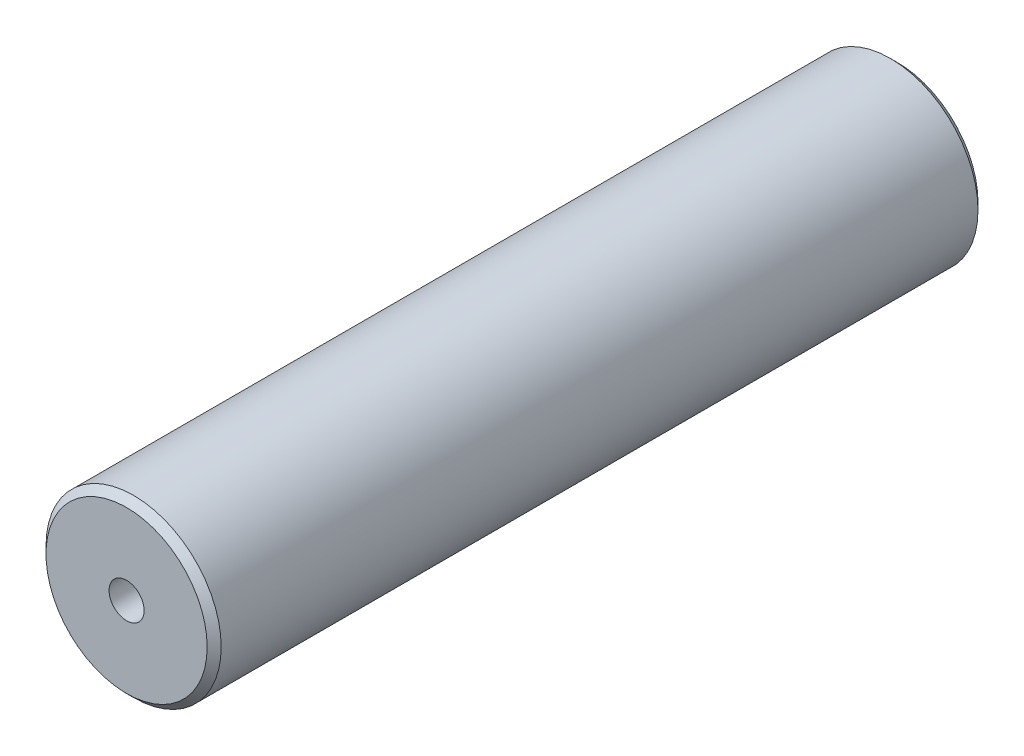
ISO-10303-21;
HEADER;
FILE_DESCRIPTION(('STEP AP214'),'2;1');
FILE_NAME('part.step','',(''),(''),'','','');
FILE_SCHEMA(('AUTOMOTIVE_DESIGN { 1 0 10303 214 1 1 1 1 }'));
ENDSEC;
DATA;
#1=APPLICATION_CONTEXT('core data for automotive mechanical design processes');
#2=APPLICATION_PROTOCOL_DEFINITION('international standard','automotive_design',2000,#1);
#3=PRODUCT_CONTEXT('',#1,'mechanical');
#4=PRODUCT('Part','Part','',(#3));
#5=PRODUCT_RELATED_PRODUCT_CATEGORY('part','',(#4));
#6=PRODUCT_DEFINITION_FORMATION('','',#4);
#7=PRODUCT_DEFINITION_CONTEXT('part definition',#1,'design');
#8=PRODUCT_DEFINITION('design','',#6,#7);
#9=PRODUCT_DEFINITION_SHAPE('','',#8);
#10=(LENGTH_UNIT() NAMED_UNIT(*) SI_UNIT(.MILLI.,.METRE.));
#11=(NAMED_UNIT(*) PLANE_ANGLE_UNIT() SI_UNIT($,.RADIAN.));
#12=(NAMED_UNIT(*) SI_UNIT($,.STERADIAN.) SOLID_ANGLE_UNIT());
#13=UNCERTAINTY_MEASURE_WITH_UNIT(LENGTH_MEASURE(1.E-05),#10,'distance_accuracy_value','');
#14=(GEOMETRIC_REPRESENTATION_CONTEXT(3) GLOBAL_UNCERTAINTY_ASSIGNED_CONTEXT((#13)) GLOBAL_UNIT_ASSIGNED_CONTEXT((#10,
#11,#12)) REPRESENTATION_CONTEXT('',''));
#15=CARTESIAN_POINT('',(0.,0.,0.));
#16=DIRECTION('',(0.,0.,1.));
#17=DIRECTION('',(1.,0.,0.));
#18=AXIS2_PLACEMENT_3D('',#15,#16,#17);
#19=CARTESIAN_POINT('',(0.,0.,55.));
#20=DIRECTION('',(0.,0.,-1.));
#21=DIRECTION('',(-1.,0.,0.));
#22=AXIS2_PLACEMENT_3D('',#19,#20,#21);
#23=CYLINDRICAL_SURFACE('',#22,12.5);
#24=CARTESIAN_POINT('',(0.,0.,-54.));
#25=DIRECTION('',(0.,0.,1.));
#26=DIRECTION('',(1.,0.,0.));
#27=AXIS2_PLACEMENT_3D('',#24,#25,#26);
#28=CIRCLE('',#27,12.5);
#29=CARTESIAN_POINT('',(12.5,0.,-54.));
#30=VERTEX_POINT('',#29);
#31=EDGE_CURVE('E83',#30,#30,#28,.T.);
#32=ORIENTED_EDGE('',*,*,#31,.T.);
#33=EDGE_LOOP('',(#32));
#34=FACE_BOUND('',#33,.T.);
#35=CARTESIAN_POINT('',(0.,0.,54.));
#36=DIRECTION('',(0.,0.,1.));
#37=DIRECTION('',(1.,0.,0.));
#38=AXIS2_PLACEMENT_3D('',#35,#36,#37);
#39=CIRCLE('',#38,12.5);
#40=CARTESIAN_POINT('',(12.5,0.,54.));
#41=VERTEX_POINT('',#40);
#42=EDGE_CURVE('E80',#41,#41,#39,.F.);
#43=ORIENTED_EDGE('',*,*,#42,.T.);
#44=EDGE_LOOP('',(#43));
#45=FACE_BOUND('',#44,.T.);
#46=ADVANCED_FACE('F44',(#34,#45),#23,.T.);
#47=CARTESIAN_POINT('',(0.,0.,55.));
#48=DIRECTION('',(0.,0.,1.));
#49=DIRECTION('',(1.,0.,0.));
#50=AXIS2_PLACEMENT_3D('',#47,#48,#49);
#51=PLANE('',#50);
#52=CARTESIAN_POINT('',(0.,0.,55.));
#53=DIRECTION('',(0.,0.,1.));
#54=DIRECTION('',(1.,0.,0.));
#55=AXIS2_PLACEMENT_3D('',#52,#53,#54);
#56=CIRCLE('',#55,2.49999999999999);
#57=CARTESIAN_POINT('',(2.49999999999999,0.,55.));
#58=VERTEX_POINT('',#57);
#59=EDGE_CURVE('E69',#58,#58,#56,.T.);
#60=ORIENTED_EDGE('',*,*,#59,.F.);
#61=EDGE_LOOP('',(#60));
#62=FACE_BOUND('',#61,.T.);
#63=CARTESIAN_POINT('',(0.,0.,55.));
#64=DIRECTION('',(0.,0.,1.));
#65=DIRECTION('',(1.,0.,0.));
#66=AXIS2_PLACEMENT_3D('',#63,#64,#65);
#67=CIRCLE('',#66,11.5);
#68=CARTESIAN_POINT('',(11.5,0.,55.));
#69=VERTEX_POINT('',#68);
#70=EDGE_CURVE('E11',#69,#69,#67,.T.);
#71=ORIENTED_EDGE('',*,*,#70,.T.);
#72=EDGE_LOOP('',(#71));
#73=FACE_BOUND('',#72,.T.);
#74=ADVANCED_FACE('F97',(#62,#73),#51,.T.);
#75=CARTESIAN_POINT('',(0.,0.,-55.));
#76=DIRECTION('',(0.,0.,1.));
#77=DIRECTION('',(1.,0.,0.));
#78=AXIS2_PLACEMENT_3D('',#75,#76,#77);
#79=PLANE('',#78);
#80=CARTESIAN_POINT('',(0.,0.,-55.));
#81=DIRECTION('',(0.,0.,-1.));
#82=DIRECTION('',(-1.,0.,0.));
#83=AXIS2_PLACEMENT_3D('',#80,#81,#82);
#84=CIRCLE('',#83,2.49999999999999);
#85=CARTESIAN_POINT('',(-2.49999999999999,0.,-55.));
#86=VERTEX_POINT('',#85);
#87=EDGE_CURVE('E70',#86,#86,#84,.T.);
#88=ORIENTED_EDGE('',*,*,#87,.F.);
#89=EDGE_LOOP('',(#88));
#90=FACE_BOUND('',#89,.T.);
#91=CARTESIAN_POINT('',(0.,0.,-55.));
#92=DIRECTION('',(0.,0.,1.));
#93=DIRECTION('',(1.,0.,0.));
#94=AXIS2_PLACEMENT_3D('',#91,#92,#93);
#95=CIRCLE('',#94,11.5);
#96=CARTESIAN_POINT('',(11.5,0.,-55.));
#97=VERTEX_POINT('',#96);
#98=EDGE_CURVE('E53',#97,#97,#95,.F.);
#99=ORIENTED_EDGE('',*,*,#98,.T.);
#100=EDGE_LOOP('',(#99));
#101=FACE_BOUND('',#100,.T.);
#102=ADVANCED_FACE('F88',(#90,#101),#79,.F.);
#103=CARTESIAN_POINT('',(0.,0.,-54.));
#104=DIRECTION('',(0.,0.,1.));
#105=DIRECTION('',(1.,0.,0.));
#106=AXIS2_PLACEMENT_3D('',#103,#104,#105);
#107=CONICAL_SURFACE('',#106,12.5,0.785398163397458);
#108=ORIENTED_EDGE('',*,*,#98,.F.);
#109=EDGE_LOOP('',(#108));
#110=FACE_BOUND('',#109,.T.);
#111=ORIENTED_EDGE('',*,*,#31,.F.);
#112=EDGE_LOOP('',(#111));
#113=FACE_BOUND('',#112,.T.);
#114=ADVANCED_FACE('F90',(#110,#113),#107,.T.);
#115=CARTESIAN_POINT('',(0.,0.,55.));
#116=DIRECTION('',(0.,0.,-1.));
#117=DIRECTION('',(-1.,0.,0.));
#118=AXIS2_PLACEMENT_3D('',#115,#116,#117);
#119=CONICAL_SURFACE('',#118,11.5,0.785398163397443);
#120=ORIENTED_EDGE('',*,*,#42,.F.);
#121=EDGE_LOOP('',(#120));
#122=FACE_BOUND('',#121,.T.);
#123=ORIENTED_EDGE('',*,*,#70,.F.);
#124=EDGE_LOOP('',(#123));
#125=FACE_BOUND('',#124,.T.);
#126=ADVANCED_FACE('F47',(#122,#125),#119,.T.);
#127=CARTESIAN_POINT('',(0.,0.,40.));
#128=DIRECTION('',(0.,0.,1.));
#129=DIRECTION('',(1.,0.,0.));
#130=AXIS2_PLACEMENT_3D('',#127,#128,#129);
#131=CONICAL_SURFACE('',#130,2.5,1.02974425867665);
#132=CARTESIAN_POINT('',(0.,0.,38.4978484524311));
#133=VERTEX_POINT('',#132);
#134=VERTEX_LOOP('',#133);
#135=FACE_BOUND('',#134,.T.);
#136=CARTESIAN_POINT('',(0.,0.,40.));
#137=DIRECTION('',(0.,0.,1.));
#138=DIRECTION('',(1.,0.,0.));
#139=AXIS2_PLACEMENT_3D('',#136,#137,#138);
#140=CIRCLE('',#139,2.5);
#141=CARTESIAN_POINT('',(2.5,0.,40.));
#142=VERTEX_POINT('',#141);
#143=EDGE_CURVE('E73',#142,#142,#140,.T.);
#144=ORIENTED_EDGE('',*,*,#143,.T.);
#145=EDGE_LOOP('',(#144));
#146=FACE_BOUND('',#145,.T.);
#147=ADVANCED_FACE('F103',(#135,#146),#131,.F.);
#148=CARTESIAN_POINT('',(0.,0.,55.));
#149=DIRECTION('',(0.,0.,1.));
#150=DIRECTION('',(1.,0.,0.));
#151=AXIS2_PLACEMENT_3D('',#148,#149,#150);
#152=CYLINDRICAL_SURFACE('',#151,2.49999999999999);
#153=ORIENTED_EDGE('',*,*,#143,.F.);
#154=EDGE_LOOP('',(#153));
#155=FACE_BOUND('',#154,.T.);
#156=ORIENTED_EDGE('',*,*,#59,.T.);
#157=EDGE_LOOP('',(#156));
#158=FACE_BOUND('',#157,.T.);
#159=ADVANCED_FACE('F63',(#155,#158),#152,.F.);
#160=CARTESIAN_POINT('',(0.,0.,-40.));
#161=DIRECTION('',(0.,0.,-1.));
#162=DIRECTION('',(-1.,0.,0.));
#163=AXIS2_PLACEMENT_3D('',#160,#161,#162);
#164=CONICAL_SURFACE('',#163,2.5,1.02974425867665);
#165=CARTESIAN_POINT('',(0.,0.,-38.4978484524311));
#166=VERTEX_POINT('',#165);
#167=VERTEX_LOOP('',#166);
#168=FACE_BOUND('',#167,.T.);
#169=CARTESIAN_POINT('',(0.,0.,-40.));
#170=DIRECTION('',(0.,0.,-1.));
#171=DIRECTION('',(-1.,0.,0.));
#172=AXIS2_PLACEMENT_3D('',#169,#170,#171);
#173=CIRCLE('',#172,2.5);
#174=CARTESIAN_POINT('',(-2.5,0.,-40.));
#175=VERTEX_POINT('',#174);
#176=EDGE_CURVE('E67',#175,#175,#173,.T.);
#177=ORIENTED_EDGE('',*,*,#176,.T.);
#178=EDGE_LOOP('',(#177));
#179=FACE_BOUND('',#178,.T.);
#180=ADVANCED_FACE('F59',(#168,#179),#164,.F.);
#181=CARTESIAN_POINT('',(0.,0.,-55.));
#182=DIRECTION('',(0.,0.,-1.));
#183=DIRECTION('',(-1.,0.,0.));
#184=AXIS2_PLACEMENT_3D('',#181,#182,#183);
#185=CYLINDRICAL_SURFACE('',#184,2.49999999999999);
#186=ORIENTED_EDGE('',*,*,#176,.F.);
#187=EDGE_LOOP('',(#186));
#188=FACE_BOUND('',#187,.T.);
#189=ORIENTED_EDGE('',*,*,#87,.T.);
#190=EDGE_LOOP('',(#189));
#191=FACE_BOUND('',#190,.T.);
#192=ADVANCED_FACE('F62',(#188,#191),#185,.F.);
#193=CLOSED_SHELL('',(#46,#74,#102,#114,#126,#147,#159,#180,#192));
#194=MANIFOLD_SOLID_BREP('B2',#193);
#195=ADVANCED_BREP_SHAPE_REPRESENTATION('',(#18,#194),#14);
#196=SHAPE_DEFINITION_REPRESENTATION(#9,#195);
ENDSEC;
END-ISO-10303-21;
